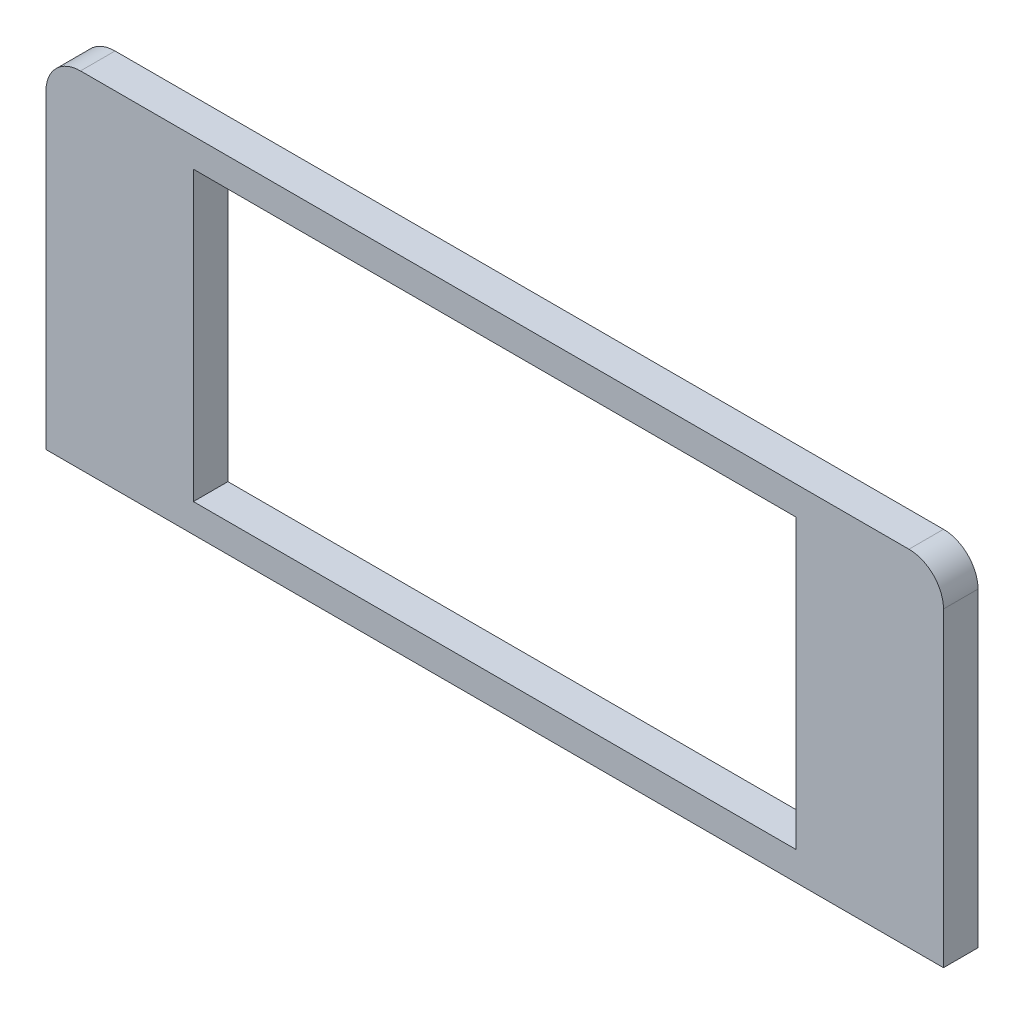
ISO-10303-21;
HEADER;
FILE_DESCRIPTION(('STEP AP214'),'2;1');
FILE_NAME('part.step','',(''),(''),'','','');
FILE_SCHEMA(('AUTOMOTIVE_DESIGN { 1 0 10303 214 1 1 1 1 }'));
ENDSEC;
DATA;
#1=APPLICATION_CONTEXT('core data for automotive mechanical design processes');
#2=APPLICATION_PROTOCOL_DEFINITION('international standard','automotive_design',2000,#1);
#3=PRODUCT_CONTEXT('',#1,'mechanical');
#4=PRODUCT('Part','Part','',(#3));
#5=PRODUCT_RELATED_PRODUCT_CATEGORY('part','',(#4));
#6=PRODUCT_DEFINITION_FORMATION('','',#4);
#7=PRODUCT_DEFINITION_CONTEXT('part definition',#1,'design');
#8=PRODUCT_DEFINITION('design','',#6,#7);
#9=PRODUCT_DEFINITION_SHAPE('','',#8);
#10=(LENGTH_UNIT() NAMED_UNIT(*) SI_UNIT(.MILLI.,.METRE.));
#11=(NAMED_UNIT(*) PLANE_ANGLE_UNIT() SI_UNIT($,.RADIAN.));
#12=(NAMED_UNIT(*) SI_UNIT($,.STERADIAN.) SOLID_ANGLE_UNIT());
#13=UNCERTAINTY_MEASURE_WITH_UNIT(LENGTH_MEASURE(1.E-05),#10,'distance_accuracy_value','');
#14=(GEOMETRIC_REPRESENTATION_CONTEXT(3) GLOBAL_UNCERTAINTY_ASSIGNED_CONTEXT((#13)) GLOBAL_UNIT_ASSIGNED_CONTEXT((#10,
#11,#12)) REPRESENTATION_CONTEXT('',''));
#15=CARTESIAN_POINT('',(0.,0.,0.));
#16=DIRECTION('',(0.,0.,1.));
#17=DIRECTION('',(1.,0.,0.));
#18=AXIS2_PLACEMENT_3D('',#15,#16,#17);
#19=CARTESIAN_POINT('',(64.9999999999998,24.9999999999999,5.));
#20=DIRECTION('',(-1.,0.,0.));
#21=DIRECTION('',(0.,0.,1.));
#22=AXIS2_PLACEMENT_3D('',#19,#20,#21);
#23=PLANE('',#22);
#24=DIRECTION('',(0.,1.,0.));
#25=VECTOR('',#24,1.);
#26=CARTESIAN_POINT('',(64.9999999999998,24.9999999999999,0.));
#27=LINE('',#26,#25);
#28=CARTESIAN_POINT('',(64.9999999999998,-25.0000000000001,0.));
#29=VERTEX_POINT('',#28);
#30=CARTESIAN_POINT('',(64.9999999999998,19.9999999999999,0.));
#31=VERTEX_POINT('',#30);
#32=EDGE_CURVE('E158',#29,#31,#27,.T.);
#33=ORIENTED_EDGE('',*,*,#32,.T.);
#34=DIRECTION('',(0.,0.,-1.));
#35=VECTOR('',#34,1.);
#36=CARTESIAN_POINT('',(64.9999999999998,19.9999999999999,5.));
#37=LINE('',#36,#35);
#38=CARTESIAN_POINT('',(64.9999999999998,19.9999999999999,5.));
#39=VERTEX_POINT('',#38);
#40=EDGE_CURVE('E212',#31,#39,#37,.F.);
#41=ORIENTED_EDGE('',*,*,#40,.T.);
#42=DIRECTION('',(0.,1.,0.));
#43=VECTOR('',#42,1.);
#44=CARTESIAN_POINT('',(64.9999999999998,24.9999999999999,5.));
#45=LINE('',#44,#43);
#46=CARTESIAN_POINT('',(64.9999999999998,-25.0000000000001,5.));
#47=VERTEX_POINT('',#46);
#48=EDGE_CURVE('E164',#47,#39,#45,.T.);
#49=ORIENTED_EDGE('',*,*,#48,.F.);
#50=DIRECTION('',(0.,0.,-1.));
#51=VECTOR('',#50,1.);
#52=CARTESIAN_POINT('',(64.9999999999998,-25.0000000000001,5.));
#53=LINE('',#52,#51);
#54=EDGE_CURVE('E179',#47,#29,#53,.T.);
#55=ORIENTED_EDGE('',*,*,#54,.T.);
#56=EDGE_LOOP('',(#33,#41,#49,#55));
#57=FACE_BOUND('',#56,.T.);
#58=ADVANCED_FACE('F38',(#57),#23,.F.);
#59=CARTESIAN_POINT('',(-65.0000000000002,24.9999999999999,5.));
#60=DIRECTION('',(0.,-1.,0.));
#61=DIRECTION('',(0.,0.,-1.));
#62=AXIS2_PLACEMENT_3D('',#59,#60,#61);
#63=PLANE('',#62);
#64=DIRECTION('',(-1.,0.,0.));
#65=VECTOR('',#64,1.);
#66=CARTESIAN_POINT('',(-65.0000000000002,24.9999999999999,5.));
#67=LINE('',#66,#65);
#68=CARTESIAN_POINT('',(59.9999999999998,24.9999999999999,5.));
#69=VERTEX_POINT('',#68);
#70=CARTESIAN_POINT('',(-60.0000000000002,24.9999999999999,5.));
#71=VERTEX_POINT('',#70);
#72=EDGE_CURVE('E168',#69,#71,#67,.T.);
#73=ORIENTED_EDGE('',*,*,#72,.F.);
#74=DIRECTION('',(0.,0.,-1.));
#75=VECTOR('',#74,1.);
#76=CARTESIAN_POINT('',(59.9999999999998,24.9999999999999,5.));
#77=LINE('',#76,#75);
#78=CARTESIAN_POINT('',(59.9999999999998,24.9999999999999,0.));
#79=VERTEX_POINT('',#78);
#80=EDGE_CURVE('E202',#69,#79,#77,.T.);
#81=ORIENTED_EDGE('',*,*,#80,.T.);
#82=DIRECTION('',(-1.,0.,0.));
#83=VECTOR('',#82,1.);
#84=CARTESIAN_POINT('',(-65.0000000000002,24.9999999999999,0.));
#85=LINE('',#84,#83);
#86=CARTESIAN_POINT('',(-60.0000000000002,24.9999999999999,0.));
#87=VERTEX_POINT('',#86);
#88=EDGE_CURVE('E183',#79,#87,#85,.T.);
#89=ORIENTED_EDGE('',*,*,#88,.T.);
#90=DIRECTION('',(0.,0.,-1.));
#91=VECTOR('',#90,1.);
#92=CARTESIAN_POINT('',(-60.0000000000002,24.9999999999999,5.));
#93=LINE('',#92,#91);
#94=EDGE_CURVE('E199',#87,#71,#93,.F.);
#95=ORIENTED_EDGE('',*,*,#94,.T.);
#96=EDGE_LOOP('',(#73,#81,#89,#95));
#97=FACE_BOUND('',#96,.T.);
#98=ADVANCED_FACE('F228',(#97),#63,.F.);
#99=CARTESIAN_POINT('',(-65.0000000000002,24.9999999999999,5.));
#100=DIRECTION('',(1.,0.,0.));
#101=DIRECTION('',(0.,0.,-1.));
#102=AXIS2_PLACEMENT_3D('',#99,#100,#101);
#103=PLANE('',#102);
#104=DIRECTION('',(0.,-1.,0.));
#105=VECTOR('',#104,1.);
#106=CARTESIAN_POINT('',(-65.0000000000002,24.9999999999999,5.));
#107=LINE('',#106,#105);
#108=CARTESIAN_POINT('',(-65.0000000000002,19.9999999999999,5.));
#109=VERTEX_POINT('',#108);
#110=CARTESIAN_POINT('',(-65.0000000000002,-25.0000000000001,5.));
#111=VERTEX_POINT('',#110);
#112=EDGE_CURVE('E173',#109,#111,#107,.T.);
#113=ORIENTED_EDGE('',*,*,#112,.F.);
#114=DIRECTION('',(0.,0.,-1.));
#115=VECTOR('',#114,1.);
#116=CARTESIAN_POINT('',(-65.0000000000002,19.9999999999999,5.));
#117=LINE('',#116,#115);
#118=CARTESIAN_POINT('',(-65.0000000000002,19.9999999999999,0.));
#119=VERTEX_POINT('',#118);
#120=EDGE_CURVE('E11',#109,#119,#117,.T.);
#121=ORIENTED_EDGE('',*,*,#120,.T.);
#122=DIRECTION('',(0.,-1.,0.));
#123=VECTOR('',#122,1.);
#124=CARTESIAN_POINT('',(-65.0000000000002,24.9999999999999,0.));
#125=LINE('',#124,#123);
#126=CARTESIAN_POINT('',(-65.0000000000002,-25.0000000000001,0.));
#127=VERTEX_POINT('',#126);
#128=EDGE_CURVE('E187',#119,#127,#125,.T.);
#129=ORIENTED_EDGE('',*,*,#128,.T.);
#130=DIRECTION('',(0.,0.,-1.));
#131=VECTOR('',#130,1.);
#132=CARTESIAN_POINT('',(-65.0000000000002,-25.0000000000001,5.));
#133=LINE('',#132,#131);
#134=EDGE_CURVE('E195',#111,#127,#133,.T.);
#135=ORIENTED_EDGE('',*,*,#134,.F.);
#136=EDGE_LOOP('',(#113,#121,#129,#135));
#137=FACE_BOUND('',#136,.T.);
#138=ADVANCED_FACE('F243',(#137),#103,.F.);
#139=CARTESIAN_POINT('',(-65.0000000000002,-25.0000000000001,5.));
#140=DIRECTION('',(0.,1.,0.));
#141=DIRECTION('',(0.,0.,1.));
#142=AXIS2_PLACEMENT_3D('',#139,#140,#141);
#143=PLANE('',#142);
#144=DIRECTION('',(1.,0.,0.));
#145=VECTOR('',#144,1.);
#146=CARTESIAN_POINT('',(-65.0000000000002,-25.0000000000001,0.));
#147=LINE('',#146,#145);
#148=EDGE_CURVE('E169',#127,#29,#147,.T.);
#149=ORIENTED_EDGE('',*,*,#148,.T.);
#150=ORIENTED_EDGE('',*,*,#54,.F.);
#151=DIRECTION('',(1.,0.,0.));
#152=VECTOR('',#151,1.);
#153=CARTESIAN_POINT('',(-65.0000000000002,-25.0000000000001,5.));
#154=LINE('',#153,#152);
#155=EDGE_CURVE('E176',#111,#47,#154,.T.);
#156=ORIENTED_EDGE('',*,*,#155,.F.);
#157=ORIENTED_EDGE('',*,*,#134,.T.);
#158=EDGE_LOOP('',(#149,#150,#156,#157));
#159=FACE_BOUND('',#158,.T.);
#160=ADVANCED_FACE('F238',(#159),#143,.F.);
#161=CARTESIAN_POINT('',(0.,0.,5.));
#162=DIRECTION('',(0.,0.,1.));
#163=DIRECTION('',(1.,0.,0.));
#164=AXIS2_PLACEMENT_3D('',#161,#162,#163);
#165=PLANE('',#164);
#166=DIRECTION('',(1.,0.,0.));
#167=VECTOR('',#166,1.);
#168=CARTESIAN_POINT('',(-43.65,-20.85,5.));
#169=LINE('',#168,#167);
#170=CARTESIAN_POINT('',(-43.65,-20.85,5.));
#171=VERTEX_POINT('',#170);
#172=CARTESIAN_POINT('',(43.65,-20.85,5.));
#173=VERTEX_POINT('',#172);
#174=EDGE_CURVE('E54',#171,#173,#169,.T.);
#175=ORIENTED_EDGE('',*,*,#174,.F.);
#176=DIRECTION('',(0.,-1.,0.));
#177=VECTOR('',#176,1.);
#178=CARTESIAN_POINT('',(-43.65,20.85,5.));
#179=LINE('',#178,#177);
#180=CARTESIAN_POINT('',(-43.65,20.85,5.));
#181=VERTEX_POINT('',#180);
#182=EDGE_CURVE('E136',#181,#171,#179,.T.);
#183=ORIENTED_EDGE('',*,*,#182,.F.);
#184=DIRECTION('',(1.,0.,0.));
#185=VECTOR('',#184,1.);
#186=CARTESIAN_POINT('',(-43.65,20.85,5.));
#187=LINE('',#186,#185);
#188=CARTESIAN_POINT('',(43.65,20.85,5.));
#189=VERTEX_POINT('',#188);
#190=EDGE_CURVE('E140',#181,#189,#187,.T.);
#191=ORIENTED_EDGE('',*,*,#190,.T.);
#192=DIRECTION('',(0.,-1.,0.));
#193=VECTOR('',#192,1.);
#194=CARTESIAN_POINT('',(43.65,20.85,5.));
#195=LINE('',#194,#193);
#196=EDGE_CURVE('E149',#189,#173,#195,.T.);
#197=ORIENTED_EDGE('',*,*,#196,.T.);
#198=EDGE_LOOP('',(#175,#183,#191,#197));
#199=FACE_BOUND('',#198,.T.);
#200=ORIENTED_EDGE('',*,*,#48,.T.);
#201=CARTESIAN_POINT('',(59.9999999999998,19.9999999999999,5.));
#202=DIRECTION('',(0.,0.,1.));
#203=DIRECTION('',(1.,0.,0.));
#204=AXIS2_PLACEMENT_3D('',#201,#202,#203);
#205=CIRCLE('',#204,5.);
#206=EDGE_CURVE('E47',#39,#69,#205,.T.);
#207=ORIENTED_EDGE('',*,*,#206,.T.);
#208=ORIENTED_EDGE('',*,*,#72,.T.);
#209=CARTESIAN_POINT('',(-60.0000000000002,19.9999999999999,5.));
#210=DIRECTION('',(0.,0.,1.));
#211=DIRECTION('',(1.,0.,0.));
#212=AXIS2_PLACEMENT_3D('',#209,#210,#211);
#213=CIRCLE('',#212,5.);
#214=EDGE_CURVE('E215',#71,#109,#213,.T.);
#215=ORIENTED_EDGE('',*,*,#214,.T.);
#216=ORIENTED_EDGE('',*,*,#112,.T.);
#217=ORIENTED_EDGE('',*,*,#155,.T.);
#218=EDGE_LOOP('',(#200,#207,#208,#215,#216,#217));
#219=FACE_BOUND('',#218,.T.);
#220=ADVANCED_FACE('F221',(#199,#219),#165,.T.);
#221=CARTESIAN_POINT('',(0.,0.,0.));
#222=DIRECTION('',(0.,0.,1.));
#223=DIRECTION('',(1.,0.,0.));
#224=AXIS2_PLACEMENT_3D('',#221,#222,#223);
#225=PLANE('',#224);
#226=DIRECTION('',(0.,-1.,0.));
#227=VECTOR('',#226,1.);
#228=CARTESIAN_POINT('',(-43.65,20.85,0.));
#229=LINE('',#228,#227);
#230=CARTESIAN_POINT('',(-43.65,20.85,0.));
#231=VERTEX_POINT('',#230);
#232=CARTESIAN_POINT('',(-43.65,-20.85,0.));
#233=VERTEX_POINT('',#232);
#234=EDGE_CURVE('E130',#231,#233,#229,.T.);
#235=ORIENTED_EDGE('',*,*,#234,.T.);
#236=DIRECTION('',(1.,0.,0.));
#237=VECTOR('',#236,1.);
#238=CARTESIAN_POINT('',(-43.65,-20.85,0.));
#239=LINE('',#238,#237);
#240=CARTESIAN_POINT('',(43.65,-20.85,0.));
#241=VERTEX_POINT('',#240);
#242=EDGE_CURVE('E124',#233,#241,#239,.T.);
#243=ORIENTED_EDGE('',*,*,#242,.T.);
#244=DIRECTION('',(0.,-1.,0.));
#245=VECTOR('',#244,1.);
#246=CARTESIAN_POINT('',(43.65,20.85,0.));
#247=LINE('',#246,#245);
#248=CARTESIAN_POINT('',(43.65,20.85,0.));
#249=VERTEX_POINT('',#248);
#250=EDGE_CURVE('E115',#249,#241,#247,.T.);
#251=ORIENTED_EDGE('',*,*,#250,.F.);
#252=DIRECTION('',(1.,0.,0.));
#253=VECTOR('',#252,1.);
#254=CARTESIAN_POINT('',(-43.65,20.85,0.));
#255=LINE('',#254,#253);
#256=EDGE_CURVE('E123',#231,#249,#255,.T.);
#257=ORIENTED_EDGE('',*,*,#256,.F.);
#258=EDGE_LOOP('',(#235,#243,#251,#257));
#259=FACE_BOUND('',#258,.T.);
#260=ORIENTED_EDGE('',*,*,#88,.F.);
#261=CARTESIAN_POINT('',(59.9999999999998,19.9999999999999,0.));
#262=DIRECTION('',(0.,0.,1.));
#263=DIRECTION('',(1.,0.,0.));
#264=AXIS2_PLACEMENT_3D('',#261,#262,#263);
#265=CIRCLE('',#264,5.);
#266=EDGE_CURVE('E209',#79,#31,#265,.F.);
#267=ORIENTED_EDGE('',*,*,#266,.T.);
#268=ORIENTED_EDGE('',*,*,#32,.F.);
#269=ORIENTED_EDGE('',*,*,#148,.F.);
#270=ORIENTED_EDGE('',*,*,#128,.F.);
#271=CARTESIAN_POINT('',(-60.0000000000002,19.9999999999999,0.));
#272=DIRECTION('',(0.,0.,1.));
#273=DIRECTION('',(1.,0.,0.));
#274=AXIS2_PLACEMENT_3D('',#271,#272,#273);
#275=CIRCLE('',#274,5.);
#276=EDGE_CURVE('E206',#119,#87,#275,.F.);
#277=ORIENTED_EDGE('',*,*,#276,.T.);
#278=EDGE_LOOP('',(#260,#267,#268,#269,#270,#277));
#279=FACE_BOUND('',#278,.T.);
#280=ADVANCED_FACE('F132',(#259,#279),#225,.F.);
#281=CARTESIAN_POINT('',(59.9999999999998,19.9999999999999,5.));
#282=DIRECTION('',(0.,0.,-1.));
#283=DIRECTION('',(-1.,0.,0.));
#284=AXIS2_PLACEMENT_3D('',#281,#282,#283);
#285=CYLINDRICAL_SURFACE('',#284,5.);
#286=ORIENTED_EDGE('',*,*,#206,.F.);
#287=ORIENTED_EDGE('',*,*,#40,.F.);
#288=ORIENTED_EDGE('',*,*,#266,.F.);
#289=ORIENTED_EDGE('',*,*,#80,.F.);
#290=EDGE_LOOP('',(#286,#287,#288,#289));
#291=FACE_BOUND('',#290,.T.);
#292=ADVANCED_FACE('F231',(#291),#285,.T.);
#293=CARTESIAN_POINT('',(-60.0000000000002,19.9999999999999,5.));
#294=DIRECTION('',(0.,0.,-1.));
#295=DIRECTION('',(-1.,0.,0.));
#296=AXIS2_PLACEMENT_3D('',#293,#294,#295);
#297=CYLINDRICAL_SURFACE('',#296,5.);
#298=ORIENTED_EDGE('',*,*,#214,.F.);
#299=ORIENTED_EDGE('',*,*,#94,.F.);
#300=ORIENTED_EDGE('',*,*,#276,.F.);
#301=ORIENTED_EDGE('',*,*,#120,.F.);
#302=EDGE_LOOP('',(#298,#299,#300,#301));
#303=FACE_BOUND('',#302,.T.);
#304=ADVANCED_FACE('F40',(#303),#297,.T.);
#305=CARTESIAN_POINT('',(-43.65,-20.85,0.));
#306=DIRECTION('',(0.,-1.,0.));
#307=DIRECTION('',(0.,0.,-1.));
#308=AXIS2_PLACEMENT_3D('',#305,#306,#307);
#309=PLANE('',#308);
#310=ORIENTED_EDGE('',*,*,#174,.T.);
#311=DIRECTION('',(0.,0.,1.));
#312=VECTOR('',#311,1.);
#313=CARTESIAN_POINT('',(43.65,-20.85,0.));
#314=LINE('',#313,#312);
#315=EDGE_CURVE('E117',#241,#173,#314,.T.);
#316=ORIENTED_EDGE('',*,*,#315,.F.);
#317=ORIENTED_EDGE('',*,*,#242,.F.);
#318=DIRECTION('',(0.,0.,1.));
#319=VECTOR('',#318,1.);
#320=CARTESIAN_POINT('',(-43.65,-20.85,0.));
#321=LINE('',#320,#319);
#322=EDGE_CURVE('E155',#233,#171,#321,.T.);
#323=ORIENTED_EDGE('',*,*,#322,.T.);
#324=EDGE_LOOP('',(#310,#316,#317,#323));
#325=FACE_BOUND('',#324,.T.);
#326=ADVANCED_FACE('F127',(#325),#309,.F.);
#327=CARTESIAN_POINT('',(-43.65,20.85,0.));
#328=DIRECTION('',(-1.,0.,0.));
#329=DIRECTION('',(0.,0.,1.));
#330=AXIS2_PLACEMENT_3D('',#327,#328,#329);
#331=PLANE('',#330);
#332=ORIENTED_EDGE('',*,*,#182,.T.);
#333=ORIENTED_EDGE('',*,*,#322,.F.);
#334=ORIENTED_EDGE('',*,*,#234,.F.);
#335=DIRECTION('',(0.,0.,1.));
#336=VECTOR('',#335,1.);
#337=CARTESIAN_POINT('',(-43.65,20.85,0.));
#338=LINE('',#337,#336);
#339=EDGE_CURVE('E159',#231,#181,#338,.T.);
#340=ORIENTED_EDGE('',*,*,#339,.T.);
#341=EDGE_LOOP('',(#332,#333,#334,#340));
#342=FACE_BOUND('',#341,.T.);
#343=ADVANCED_FACE('F251',(#342),#331,.F.);
#344=CARTESIAN_POINT('',(-43.65,20.85,0.));
#345=DIRECTION('',(0.,-1.,0.));
#346=DIRECTION('',(0.,0.,-1.));
#347=AXIS2_PLACEMENT_3D('',#344,#345,#346);
#348=PLANE('',#347);
#349=ORIENTED_EDGE('',*,*,#190,.F.);
#350=ORIENTED_EDGE('',*,*,#339,.F.);
#351=ORIENTED_EDGE('',*,*,#256,.T.);
#352=DIRECTION('',(0.,0.,1.));
#353=VECTOR('',#352,1.);
#354=CARTESIAN_POINT('',(43.65,20.85,0.));
#355=LINE('',#354,#353);
#356=EDGE_CURVE('E62',#249,#189,#355,.T.);
#357=ORIENTED_EDGE('',*,*,#356,.T.);
#358=EDGE_LOOP('',(#349,#350,#351,#357));
#359=FACE_BOUND('',#358,.T.);
#360=ADVANCED_FACE('F271',(#359),#348,.T.);
#361=CARTESIAN_POINT('',(43.65,20.85,0.));
#362=DIRECTION('',(-1.,0.,0.));
#363=DIRECTION('',(0.,-1.,0.));
#364=AXIS2_PLACEMENT_3D('',#361,#362,#363);
#365=PLANE('',#364);
#366=ORIENTED_EDGE('',*,*,#196,.F.);
#367=ORIENTED_EDGE('',*,*,#356,.F.);
#368=ORIENTED_EDGE('',*,*,#250,.T.);
#369=ORIENTED_EDGE('',*,*,#315,.T.);
#370=EDGE_LOOP('',(#366,#367,#368,#369));
#371=FACE_BOUND('',#370,.T.);
#372=ADVANCED_FACE('F116',(#371),#365,.T.);
#373=CLOSED_SHELL('',(#58,#98,#138,#160,#220,#280,#292,#304,#326,#343,#360,#372));
#374=MANIFOLD_SOLID_BREP('B2',#373);
#375=ADVANCED_BREP_SHAPE_REPRESENTATION('',(#18,#374),#14);
#376=SHAPE_DEFINITION_REPRESENTATION(#9,#375);
ENDSEC;
END-ISO-10303-21;
